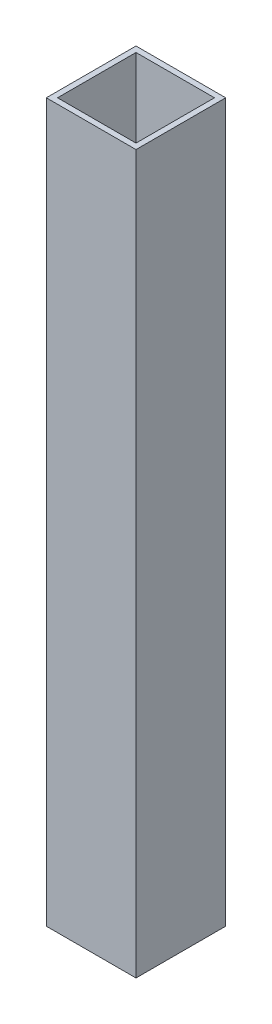
ISO-10303-21;
HEADER;
FILE_DESCRIPTION(('STEP AP214'),'2;1');
FILE_NAME('part.step','',(''),(''),'','','');
FILE_SCHEMA(('AUTOMOTIVE_DESIGN { 1 0 10303 214 1 1 1 1 }'));
ENDSEC;
DATA;
#1=APPLICATION_CONTEXT('core data for automotive mechanical design processes');
#2=APPLICATION_PROTOCOL_DEFINITION('international standard','automotive_design',2000,#1);
#3=PRODUCT_CONTEXT('',#1,'mechanical');
#4=PRODUCT('Part','Part','',(#3));
#5=PRODUCT_RELATED_PRODUCT_CATEGORY('part','',(#4));
#6=PRODUCT_DEFINITION_FORMATION('','',#4);
#7=PRODUCT_DEFINITION_CONTEXT('part definition',#1,'design');
#8=PRODUCT_DEFINITION('design','',#6,#7);
#9=PRODUCT_DEFINITION_SHAPE('','',#8);
#10=(LENGTH_UNIT() NAMED_UNIT(*) SI_UNIT(.MILLI.,.METRE.));
#11=(NAMED_UNIT(*) PLANE_ANGLE_UNIT() SI_UNIT($,.RADIAN.));
#12=(NAMED_UNIT(*) SI_UNIT($,.STERADIAN.) SOLID_ANGLE_UNIT());
#13=UNCERTAINTY_MEASURE_WITH_UNIT(LENGTH_MEASURE(1.E-05),#10,'distance_accuracy_value','');
#14=(GEOMETRIC_REPRESENTATION_CONTEXT(3) GLOBAL_UNCERTAINTY_ASSIGNED_CONTEXT((#13)) GLOBAL_UNIT_ASSIGNED_CONTEXT((#10,
#11,#12)) REPRESENTATION_CONTEXT('',''));
#15=CARTESIAN_POINT('',(0.,0.,0.));
#16=DIRECTION('',(0.,0.,1.));
#17=DIRECTION('',(1.,0.,0.));
#18=AXIS2_PLACEMENT_3D('',#15,#16,#17);
#19=CARTESIAN_POINT('',(0.,203.2,0.));
#20=DIRECTION('',(0.,-1.,0.));
#21=DIRECTION('',(0.,0.,-1.));
#22=AXIS2_PLACEMENT_3D('',#19,#20,#21);
#23=PLANE('',#22);
#24=DIRECTION('',(0.,0.,1.));
#25=VECTOR('',#24,1.);
#26=CARTESIAN_POINT('',(-12.7,203.2,-12.7));
#27=LINE('',#26,#25);
#28=CARTESIAN_POINT('',(-12.7,203.2,-12.7));
#29=VERTEX_POINT('',#28);
#30=CARTESIAN_POINT('',(-12.7,203.2,12.7));
#31=VERTEX_POINT('',#30);
#32=EDGE_CURVE('E157',#29,#31,#27,.T.);
#33=ORIENTED_EDGE('',*,*,#32,.T.);
#34=DIRECTION('',(1.,0.,0.));
#35=VECTOR('',#34,1.);
#36=CARTESIAN_POINT('',(12.7,203.2,12.7));
#37=LINE('',#36,#35);
#38=CARTESIAN_POINT('',(12.7,203.2,12.7));
#39=VERTEX_POINT('',#38);
#40=EDGE_CURVE('E160',#31,#39,#37,.T.);
#41=ORIENTED_EDGE('',*,*,#40,.T.);
#42=DIRECTION('',(0.,0.,-1.));
#43=VECTOR('',#42,1.);
#44=CARTESIAN_POINT('',(12.7,203.2,-12.7));
#45=LINE('',#44,#43);
#46=CARTESIAN_POINT('',(12.7,203.2,-12.7));
#47=VERTEX_POINT('',#46);
#48=EDGE_CURVE('E163',#39,#47,#45,.T.);
#49=ORIENTED_EDGE('',*,*,#48,.T.);
#50=DIRECTION('',(-1.,0.,0.));
#51=VECTOR('',#50,1.);
#52=CARTESIAN_POINT('',(12.7,203.2,-12.7));
#53=LINE('',#52,#51);
#54=EDGE_CURVE('E165',#47,#29,#53,.T.);
#55=ORIENTED_EDGE('',*,*,#54,.T.);
#56=EDGE_LOOP('',(#33,#41,#49,#55));
#57=FACE_BOUND('',#56,.T.);
#58=DIRECTION('',(-1.,0.,0.));
#59=VECTOR('',#58,1.);
#60=CARTESIAN_POINT('',(11.1125,203.2,-11.1125));
#61=LINE('',#60,#59);
#62=CARTESIAN_POINT('',(11.1125,203.2,-11.1125));
#63=VERTEX_POINT('',#62);
#64=CARTESIAN_POINT('',(-11.1125,203.2,-11.1125));
#65=VERTEX_POINT('',#64);
#66=EDGE_CURVE('E113',#63,#65,#61,.T.);
#67=ORIENTED_EDGE('',*,*,#66,.F.);
#68=DIRECTION('',(0.,0.,-1.));
#69=VECTOR('',#68,1.);
#70=CARTESIAN_POINT('',(11.1125,203.2,-11.1125));
#71=LINE('',#70,#69);
#72=CARTESIAN_POINT('',(11.1125,203.2,11.1125));
#73=VERTEX_POINT('',#72);
#74=EDGE_CURVE('E136',#73,#63,#71,.T.);
#75=ORIENTED_EDGE('',*,*,#74,.F.);
#76=DIRECTION('',(1.,0.,0.));
#77=VECTOR('',#76,1.);
#78=CARTESIAN_POINT('',(11.1125,203.2,11.1125));
#79=LINE('',#78,#77);
#80=CARTESIAN_POINT('',(-11.1125,203.2,11.1125));
#81=VERTEX_POINT('',#80);
#82=EDGE_CURVE('E134',#81,#73,#79,.T.);
#83=ORIENTED_EDGE('',*,*,#82,.F.);
#84=DIRECTION('',(0.,0.,1.));
#85=VECTOR('',#84,1.);
#86=CARTESIAN_POINT('',(-11.1125,203.2,-11.1125));
#87=LINE('',#86,#85);
#88=EDGE_CURVE('E121',#65,#81,#87,.T.);
#89=ORIENTED_EDGE('',*,*,#88,.F.);
#90=EDGE_LOOP('',(#67,#75,#83,#89));
#91=FACE_BOUND('',#90,.T.);
#92=ADVANCED_FACE('F40',(#57,#91),#23,.F.);
#93=CARTESIAN_POINT('',(0.,0.,0.));
#94=DIRECTION('',(0.,-1.,0.));
#95=DIRECTION('',(0.,0.,-1.));
#96=AXIS2_PLACEMENT_3D('',#93,#94,#95);
#97=PLANE('',#96);
#98=DIRECTION('',(0.,0.,1.));
#99=VECTOR('',#98,1.);
#100=CARTESIAN_POINT('',(-12.7,0.,-12.7));
#101=LINE('',#100,#99);
#102=CARTESIAN_POINT('',(-12.7,0.,-12.7));
#103=VERTEX_POINT('',#102);
#104=CARTESIAN_POINT('',(-12.7,0.,12.7));
#105=VERTEX_POINT('',#104);
#106=EDGE_CURVE('E130',#103,#105,#101,.T.);
#107=ORIENTED_EDGE('',*,*,#106,.F.);
#108=DIRECTION('',(-1.,0.,0.));
#109=VECTOR('',#108,1.);
#110=CARTESIAN_POINT('',(12.7,0.,-12.7));
#111=LINE('',#110,#109);
#112=CARTESIAN_POINT('',(12.7,0.,-12.7));
#113=VERTEX_POINT('',#112);
#114=EDGE_CURVE('E161',#113,#103,#111,.T.);
#115=ORIENTED_EDGE('',*,*,#114,.F.);
#116=DIRECTION('',(0.,0.,-1.));
#117=VECTOR('',#116,1.);
#118=CARTESIAN_POINT('',(12.7,0.,-12.7));
#119=LINE('',#118,#117);
#120=CARTESIAN_POINT('',(12.7,0.,12.7));
#121=VERTEX_POINT('',#120);
#122=EDGE_CURVE('E174',#121,#113,#119,.T.);
#123=ORIENTED_EDGE('',*,*,#122,.F.);
#124=DIRECTION('',(1.,0.,0.));
#125=VECTOR('',#124,1.);
#126=CARTESIAN_POINT('',(12.7,0.,12.7));
#127=LINE('',#126,#125);
#128=EDGE_CURVE('E171',#105,#121,#127,.T.);
#129=ORIENTED_EDGE('',*,*,#128,.F.);
#130=EDGE_LOOP('',(#107,#115,#123,#129));
#131=FACE_BOUND('',#130,.T.);
#132=DIRECTION('',(0.,0.,-1.));
#133=VECTOR('',#132,1.);
#134=CARTESIAN_POINT('',(11.1125,0.,-11.1125));
#135=LINE('',#134,#133);
#136=CARTESIAN_POINT('',(11.1125,0.,11.1125));
#137=VERTEX_POINT('',#136);
#138=CARTESIAN_POINT('',(11.1125,0.,-11.1125));
#139=VERTEX_POINT('',#138);
#140=EDGE_CURVE('E122',#137,#139,#135,.T.);
#141=ORIENTED_EDGE('',*,*,#140,.T.);
#142=DIRECTION('',(-1.,0.,0.));
#143=VECTOR('',#142,1.);
#144=CARTESIAN_POINT('',(11.1125,0.,-11.1125));
#145=LINE('',#144,#143);
#146=CARTESIAN_POINT('',(-11.1125,0.,-11.1125));
#147=VERTEX_POINT('',#146);
#148=EDGE_CURVE('E67',#139,#147,#145,.T.);
#149=ORIENTED_EDGE('',*,*,#148,.T.);
#150=DIRECTION('',(0.,0.,1.));
#151=VECTOR('',#150,1.);
#152=CARTESIAN_POINT('',(-11.1125,0.,-11.1125));
#153=LINE('',#152,#151);
#154=CARTESIAN_POINT('',(-11.1125,0.,11.1125));
#155=VERTEX_POINT('',#154);
#156=EDGE_CURVE('E128',#147,#155,#153,.T.);
#157=ORIENTED_EDGE('',*,*,#156,.T.);
#158=DIRECTION('',(1.,0.,0.));
#159=VECTOR('',#158,1.);
#160=CARTESIAN_POINT('',(11.1125,0.,11.1125));
#161=LINE('',#160,#159);
#162=EDGE_CURVE('E144',#155,#137,#161,.T.);
#163=ORIENTED_EDGE('',*,*,#162,.T.);
#164=EDGE_LOOP('',(#141,#149,#157,#163));
#165=FACE_BOUND('',#164,.T.);
#166=ADVANCED_FACE('F197',(#131,#165),#97,.T.);
#167=CARTESIAN_POINT('',(-12.7,203.2,-12.7));
#168=DIRECTION('',(1.,0.,0.));
#169=DIRECTION('',(0.,0.,-1.));
#170=AXIS2_PLACEMENT_3D('',#167,#168,#169);
#171=PLANE('',#170);
#172=ORIENTED_EDGE('',*,*,#106,.T.);
#173=DIRECTION('',(0.,-1.,0.));
#174=VECTOR('',#173,1.);
#175=CARTESIAN_POINT('',(-12.7,203.2,12.7));
#176=LINE('',#175,#174);
#177=EDGE_CURVE('E11',#31,#105,#176,.T.);
#178=ORIENTED_EDGE('',*,*,#177,.F.);
#179=ORIENTED_EDGE('',*,*,#32,.F.);
#180=DIRECTION('',(0.,-1.,0.));
#181=VECTOR('',#180,1.);
#182=CARTESIAN_POINT('',(-12.7,203.2,-12.7));
#183=LINE('',#182,#181);
#184=EDGE_CURVE('E167',#29,#103,#183,.T.);
#185=ORIENTED_EDGE('',*,*,#184,.T.);
#186=EDGE_LOOP('',(#172,#178,#179,#185));
#187=FACE_BOUND('',#186,.T.);
#188=ADVANCED_FACE('F42',(#187),#171,.F.);
#189=CARTESIAN_POINT('',(12.7,203.2,12.7));
#190=DIRECTION('',(0.,0.,-1.));
#191=DIRECTION('',(-1.,0.,0.));
#192=AXIS2_PLACEMENT_3D('',#189,#190,#191);
#193=PLANE('',#192);
#194=ORIENTED_EDGE('',*,*,#128,.T.);
#195=DIRECTION('',(0.,-1.,0.));
#196=VECTOR('',#195,1.);
#197=CARTESIAN_POINT('',(12.7,203.2,12.7));
#198=LINE('',#197,#196);
#199=EDGE_CURVE('E49',#39,#121,#198,.T.);
#200=ORIENTED_EDGE('',*,*,#199,.F.);
#201=ORIENTED_EDGE('',*,*,#40,.F.);
#202=ORIENTED_EDGE('',*,*,#177,.T.);
#203=EDGE_LOOP('',(#194,#200,#201,#202));
#204=FACE_BOUND('',#203,.T.);
#205=ADVANCED_FACE('F207',(#204),#193,.F.);
#206=CARTESIAN_POINT('',(12.7,203.2,-12.7));
#207=DIRECTION('',(-1.,0.,0.));
#208=DIRECTION('',(0.,0.,1.));
#209=AXIS2_PLACEMENT_3D('',#206,#207,#208);
#210=PLANE('',#209);
#211=ORIENTED_EDGE('',*,*,#122,.T.);
#212=DIRECTION('',(0.,-1.,0.));
#213=VECTOR('',#212,1.);
#214=CARTESIAN_POINT('',(12.7,203.2,-12.7));
#215=LINE('',#214,#213);
#216=EDGE_CURVE('E182',#47,#113,#215,.T.);
#217=ORIENTED_EDGE('',*,*,#216,.F.);
#218=ORIENTED_EDGE('',*,*,#48,.F.);
#219=ORIENTED_EDGE('',*,*,#199,.T.);
#220=EDGE_LOOP('',(#211,#217,#218,#219));
#221=FACE_BOUND('',#220,.T.);
#222=ADVANCED_FACE('F191',(#221),#210,.F.);
#223=CARTESIAN_POINT('',(12.7,203.2,-12.7));
#224=DIRECTION('',(0.,0.,1.));
#225=DIRECTION('',(1.,0.,0.));
#226=AXIS2_PLACEMENT_3D('',#223,#224,#225);
#227=PLANE('',#226);
#228=ORIENTED_EDGE('',*,*,#114,.T.);
#229=ORIENTED_EDGE('',*,*,#184,.F.);
#230=ORIENTED_EDGE('',*,*,#54,.F.);
#231=ORIENTED_EDGE('',*,*,#216,.T.);
#232=EDGE_LOOP('',(#228,#229,#230,#231));
#233=FACE_BOUND('',#232,.T.);
#234=ADVANCED_FACE('F201',(#233),#227,.F.);
#235=CARTESIAN_POINT('',(11.1125,203.2,-11.1125));
#236=DIRECTION('',(0.,0.,1.));
#237=DIRECTION('',(1.,0.,0.));
#238=AXIS2_PLACEMENT_3D('',#235,#236,#237);
#239=PLANE('',#238);
#240=ORIENTED_EDGE('',*,*,#148,.F.);
#241=DIRECTION('',(0.,-1.,0.));
#242=VECTOR('',#241,1.);
#243=CARTESIAN_POINT('',(11.1125,203.2,-11.1125));
#244=LINE('',#243,#242);
#245=EDGE_CURVE('E117',#63,#139,#244,.T.);
#246=ORIENTED_EDGE('',*,*,#245,.F.);
#247=ORIENTED_EDGE('',*,*,#66,.T.);
#248=DIRECTION('',(0.,-1.,0.));
#249=VECTOR('',#248,1.);
#250=CARTESIAN_POINT('',(-11.1125,203.2,-11.1125));
#251=LINE('',#250,#249);
#252=EDGE_CURVE('E116',#65,#147,#251,.T.);
#253=ORIENTED_EDGE('',*,*,#252,.T.);
#254=EDGE_LOOP('',(#240,#246,#247,#253));
#255=FACE_BOUND('',#254,.T.);
#256=ADVANCED_FACE('F115',(#255),#239,.T.);
#257=CARTESIAN_POINT('',(-11.1125,203.2,-11.1125));
#258=DIRECTION('',(1.,0.,0.));
#259=DIRECTION('',(0.,0.,-1.));
#260=AXIS2_PLACEMENT_3D('',#257,#258,#259);
#261=PLANE('',#260);
#262=ORIENTED_EDGE('',*,*,#156,.F.);
#263=ORIENTED_EDGE('',*,*,#252,.F.);
#264=ORIENTED_EDGE('',*,*,#88,.T.);
#265=DIRECTION('',(0.,-1.,0.));
#266=VECTOR('',#265,1.);
#267=CARTESIAN_POINT('',(-11.1125,203.2,11.1125));
#268=LINE('',#267,#266);
#269=EDGE_CURVE('E131',#81,#155,#268,.T.);
#270=ORIENTED_EDGE('',*,*,#269,.T.);
#271=EDGE_LOOP('',(#262,#263,#264,#270));
#272=FACE_BOUND('',#271,.T.);
#273=ADVANCED_FACE('F125',(#272),#261,.T.);
#274=CARTESIAN_POINT('',(11.1125,203.2,11.1125));
#275=DIRECTION('',(0.,0.,-1.));
#276=DIRECTION('',(-1.,0.,0.));
#277=AXIS2_PLACEMENT_3D('',#274,#275,#276);
#278=PLANE('',#277);
#279=ORIENTED_EDGE('',*,*,#162,.F.);
#280=ORIENTED_EDGE('',*,*,#269,.F.);
#281=ORIENTED_EDGE('',*,*,#82,.T.);
#282=DIRECTION('',(0.,-1.,0.));
#283=VECTOR('',#282,1.);
#284=CARTESIAN_POINT('',(11.1125,203.2,11.1125));
#285=LINE('',#284,#283);
#286=EDGE_CURVE('E56',#73,#137,#285,.T.);
#287=ORIENTED_EDGE('',*,*,#286,.T.);
#288=EDGE_LOOP('',(#279,#280,#281,#287));
#289=FACE_BOUND('',#288,.T.);
#290=ADVANCED_FACE('F230',(#289),#278,.T.);
#291=CARTESIAN_POINT('',(11.1125,203.2,-11.1125));
#292=DIRECTION('',(-1.,0.,0.));
#293=DIRECTION('',(0.,0.,1.));
#294=AXIS2_PLACEMENT_3D('',#291,#292,#293);
#295=PLANE('',#294);
#296=ORIENTED_EDGE('',*,*,#140,.F.);
#297=ORIENTED_EDGE('',*,*,#286,.F.);
#298=ORIENTED_EDGE('',*,*,#74,.T.);
#299=ORIENTED_EDGE('',*,*,#245,.T.);
#300=EDGE_LOOP('',(#296,#297,#298,#299));
#301=FACE_BOUND('',#300,.T.);
#302=ADVANCED_FACE('F234',(#301),#295,.T.);
#303=CLOSED_SHELL('',(#92,#166,#188,#205,#222,#234,#256,#273,#290,#302));
#304=MANIFOLD_SOLID_BREP('B2',#303);
#305=ADVANCED_BREP_SHAPE_REPRESENTATION('',(#18,#304),#14);
#306=SHAPE_DEFINITION_REPRESENTATION(#9,#305);
ENDSEC;
END-ISO-10303-21;
